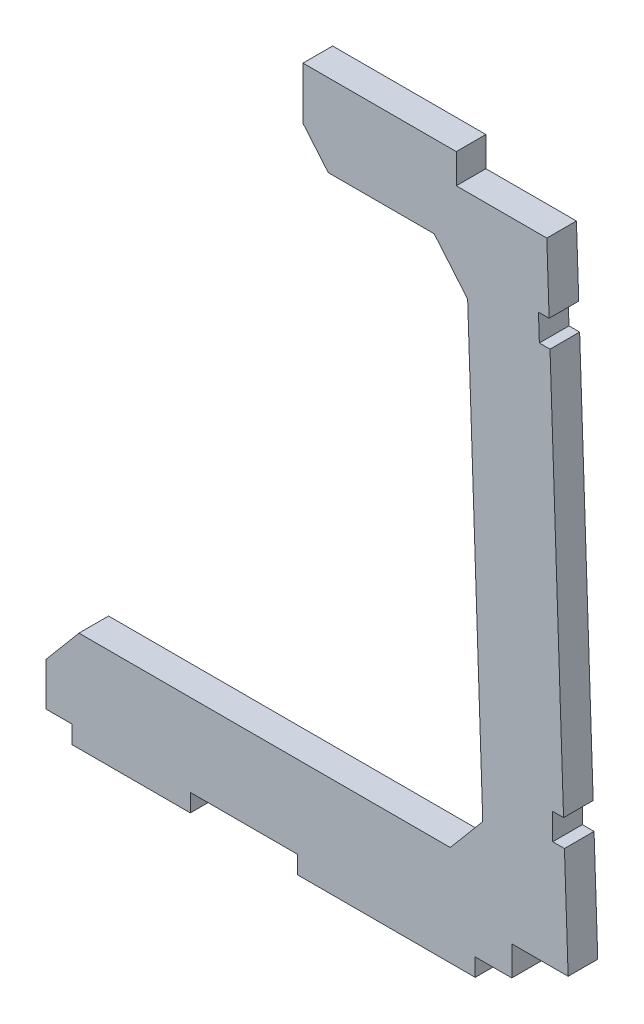
ISO-10303-21;
HEADER;
FILE_DESCRIPTION(('STEP AP214'),'2;1');
FILE_NAME('part.step','',(''),(''),'','','');
FILE_SCHEMA(('AUTOMOTIVE_DESIGN { 1 0 10303 214 1 1 1 1 }'));
ENDSEC;
DATA;
#1=APPLICATION_CONTEXT('core data for automotive mechanical design processes');
#2=APPLICATION_PROTOCOL_DEFINITION('international standard','automotive_design',2000,#1);
#3=PRODUCT_CONTEXT('',#1,'mechanical');
#4=PRODUCT('Part','Part','',(#3));
#5=PRODUCT_RELATED_PRODUCT_CATEGORY('part','',(#4));
#6=PRODUCT_DEFINITION_FORMATION('','',#4);
#7=PRODUCT_DEFINITION_CONTEXT('part definition',#1,'design');
#8=PRODUCT_DEFINITION('design','',#6,#7);
#9=PRODUCT_DEFINITION_SHAPE('','',#8);
#10=(LENGTH_UNIT() NAMED_UNIT(*) SI_UNIT(.MILLI.,.METRE.));
#11=(NAMED_UNIT(*) PLANE_ANGLE_UNIT() SI_UNIT($,.RADIAN.));
#12=(NAMED_UNIT(*) SI_UNIT($,.STERADIAN.) SOLID_ANGLE_UNIT());
#13=UNCERTAINTY_MEASURE_WITH_UNIT(LENGTH_MEASURE(1.E-05),#10,'distance_accuracy_value','');
#14=(GEOMETRIC_REPRESENTATION_CONTEXT(3) GLOBAL_UNCERTAINTY_ASSIGNED_CONTEXT((#13)) GLOBAL_UNIT_ASSIGNED_CONTEXT((#10,
#11,#12)) REPRESENTATION_CONTEXT('',''));
#15=CARTESIAN_POINT('',(0.,0.,0.));
#16=DIRECTION('',(0.,0.,1.));
#17=DIRECTION('',(1.,0.,0.));
#18=AXIS2_PLACEMENT_3D('',#15,#16,#17);
#19=CARTESIAN_POINT('',(0.,5.,5.));
#20=DIRECTION('',(0.,1.,0.));
#21=DIRECTION('',(0.,0.,1.));
#22=AXIS2_PLACEMENT_3D('',#19,#20,#21);
#23=PLANE('',#22);
#24=DIRECTION('',(1.,0.,0.));
#25=VECTOR('',#24,1.);
#26=CARTESIAN_POINT('',(0.,5.,0.));
#27=LINE('',#26,#25);
#28=CARTESIAN_POINT('',(97.6588701243486,5.,0.));
#29=VERTEX_POINT('',#28);
#30=CARTESIAN_POINT('',(107.170761617461,5.,0.));
#31=VERTEX_POINT('',#30);
#32=EDGE_CURVE('E279',#29,#31,#27,.T.);
#33=ORIENTED_EDGE('',*,*,#32,.T.);
#34=DIRECTION('',(0.,0.,-1.));
#35=VECTOR('',#34,1.);
#36=CARTESIAN_POINT('',(107.170761617461,5.,5.));
#37=LINE('',#36,#35);
#38=CARTESIAN_POINT('',(107.170761617461,5.,5.));
#39=VERTEX_POINT('',#38);
#40=EDGE_CURVE('E11',#39,#31,#37,.T.);
#41=ORIENTED_EDGE('',*,*,#40,.F.);
#42=DIRECTION('',(1.,0.,0.));
#43=VECTOR('',#42,1.);
#44=CARTESIAN_POINT('',(0.,5.,5.));
#45=LINE('',#44,#43);
#46=CARTESIAN_POINT('',(97.6588701243486,5.,5.));
#47=VERTEX_POINT('',#46);
#48=EDGE_CURVE('E358',#47,#39,#45,.T.);
#49=ORIENTED_EDGE('',*,*,#48,.F.);
#50=DIRECTION('',(0.,0.,-1.));
#51=VECTOR('',#50,1.);
#52=CARTESIAN_POINT('',(97.6588701243486,5.,5.));
#53=LINE('',#52,#51);
#54=EDGE_CURVE('E275',#47,#29,#53,.T.);
#55=ORIENTED_EDGE('',*,*,#54,.T.);
#56=EDGE_LOOP('',(#33,#41,#49,#55));
#57=FACE_BOUND('',#56,.T.);
#58=ADVANCED_FACE('F39',(#57),#23,.F.);
#59=CARTESIAN_POINT('',(107.216949366486,3.63924995126501,5.));
#60=DIRECTION('',(-0.999424438400247,-0.0339233242526677,0.));
#61=DIRECTION('',(0.0339233242526677,-0.999424438400247,0.));
#62=AXIS2_PLACEMENT_3D('',#59,#60,#61);
#63=PLANE('',#62);
#64=DIRECTION('',(-0.0339233242526677,0.999424438400247,0.));
#65=VECTOR('',#64,1.);
#66=CARTESIAN_POINT('',(107.216949366486,3.63924995126501,0.));
#67=LINE('',#66,#65);
#68=CARTESIAN_POINT('',(106.54703003609,23.3759286319028,0.));
#69=VERTEX_POINT('',#68);
#70=EDGE_CURVE('E282',#31,#69,#67,.T.);
#71=ORIENTED_EDGE('',*,*,#70,.T.);
#72=DIRECTION('',(0.,0.,-1.));
#73=VECTOR('',#72,1.);
#74=CARTESIAN_POINT('',(106.54703003609,23.3759286319028,5.));
#75=LINE('',#74,#73);
#76=CARTESIAN_POINT('',(106.54703003609,23.3759286319028,5.));
#77=VERTEX_POINT('',#76);
#78=EDGE_CURVE('E47',#77,#69,#75,.T.);
#79=ORIENTED_EDGE('',*,*,#78,.F.);
#80=DIRECTION('',(-0.0339233242526677,0.999424438400247,0.));
#81=VECTOR('',#80,1.);
#82=CARTESIAN_POINT('',(107.216949366486,3.63924995126501,5.));
#83=LINE('',#82,#81);
#84=EDGE_CURVE('E170',#39,#77,#83,.T.);
#85=ORIENTED_EDGE('',*,*,#84,.F.);
#86=ORIENTED_EDGE('',*,*,#40,.T.);
#87=EDGE_LOOP('',(#71,#79,#85,#86));
#88=FACE_BOUND('',#87,.T.);
#89=ADVANCED_FACE('F426',(#88),#63,.F.);
#90=CARTESIAN_POINT('',(0.,23.375928631903,5.));
#91=DIRECTION('',(0.,1.,0.));
#92=DIRECTION('',(-1.,0.,0.));
#93=AXIS2_PLACEMENT_3D('',#90,#91,#92);
#94=PLANE('',#93);
#95=DIRECTION('',(1.,0.,0.));
#96=VECTOR('',#95,1.);
#97=CARTESIAN_POINT('',(0.,23.375928631903,0.));
#98=LINE('',#97,#96);
#99=CARTESIAN_POINT('',(104.569940490293,23.3759286319028,0.));
#100=VERTEX_POINT('',#99);
#101=EDGE_CURVE('E285',#100,#69,#98,.T.);
#102=ORIENTED_EDGE('',*,*,#101,.F.);
#103=DIRECTION('',(0.,0.,-1.));
#104=VECTOR('',#103,1.);
#105=CARTESIAN_POINT('',(104.569940490293,23.3759286319028,5.));
#106=LINE('',#105,#104);
#107=CARTESIAN_POINT('',(104.569940490293,23.3759286319028,5.));
#108=VERTEX_POINT('',#107);
#109=EDGE_CURVE('E419',#108,#100,#106,.T.);
#110=ORIENTED_EDGE('',*,*,#109,.F.);
#111=DIRECTION('',(1.,0.,0.));
#112=VECTOR('',#111,1.);
#113=CARTESIAN_POINT('',(0.,23.375928631903,5.));
#114=LINE('',#113,#112);
#115=EDGE_CURVE('E425',#108,#77,#114,.T.);
#116=ORIENTED_EDGE('',*,*,#115,.T.);
#117=ORIENTED_EDGE('',*,*,#78,.T.);
#118=EDGE_LOOP('',(#102,#110,#116,#117));
#119=FACE_BOUND('',#118,.T.);
#120=ADVANCED_FACE('F423',(#119),#94,.T.);
#121=CARTESIAN_POINT('',(104.569940490293,0.,5.));
#122=DIRECTION('',(1.,0.,0.));
#123=DIRECTION('',(0.,0.,-1.));
#124=AXIS2_PLACEMENT_3D('',#121,#122,#123);
#125=PLANE('',#124);
#126=DIRECTION('',(0.,-1.,0.));
#127=VECTOR('',#126,1.);
#128=CARTESIAN_POINT('',(104.569940490293,0.,0.));
#129=LINE('',#128,#127);
#130=CARTESIAN_POINT('',(104.569940490293,27.8169237547511,0.));
#131=VERTEX_POINT('',#130);
#132=EDGE_CURVE('E290',#131,#100,#129,.T.);
#133=ORIENTED_EDGE('',*,*,#132,.F.);
#134=DIRECTION('',(0.,0.,-1.));
#135=VECTOR('',#134,1.);
#136=CARTESIAN_POINT('',(104.569940490293,27.8169237547511,5.));
#137=LINE('',#136,#135);
#138=CARTESIAN_POINT('',(104.569940490293,27.8169237547511,5.));
#139=VERTEX_POINT('',#138);
#140=EDGE_CURVE('E417',#139,#131,#137,.T.);
#141=ORIENTED_EDGE('',*,*,#140,.F.);
#142=DIRECTION('',(0.,-1.,0.));
#143=VECTOR('',#142,1.);
#144=CARTESIAN_POINT('',(104.569940490293,0.,5.));
#145=LINE('',#144,#143);
#146=EDGE_CURVE('E438',#139,#108,#145,.T.);
#147=ORIENTED_EDGE('',*,*,#146,.T.);
#148=ORIENTED_EDGE('',*,*,#109,.T.);
#149=EDGE_LOOP('',(#133,#141,#147,#148));
#150=FACE_BOUND('',#149,.T.);
#151=ADVANCED_FACE('F435',(#150),#125,.T.);
#152=CARTESIAN_POINT('',(0.,27.8169237547511,5.));
#153=DIRECTION('',(0.,-1.,0.));
#154=DIRECTION('',(0.,0.,-1.));
#155=AXIS2_PLACEMENT_3D('',#152,#153,#154);
#156=PLANE('',#155);
#157=DIRECTION('',(-1.,0.,0.));
#158=VECTOR('',#157,1.);
#159=CARTESIAN_POINT('',(0.,27.8169237547511,0.));
#160=LINE('',#159,#158);
#161=CARTESIAN_POINT('',(106.396289958333,27.8169237547511,0.));
#162=VERTEX_POINT('',#161);
#163=EDGE_CURVE('E293',#162,#131,#160,.T.);
#164=ORIENTED_EDGE('',*,*,#163,.F.);
#165=DIRECTION('',(0.,0.,-1.));
#166=VECTOR('',#165,1.);
#167=CARTESIAN_POINT('',(106.396289958333,27.8169237547511,5.));
#168=LINE('',#167,#166);
#169=CARTESIAN_POINT('',(106.396289958333,27.8169237547511,5.));
#170=VERTEX_POINT('',#169);
#171=EDGE_CURVE('E415',#170,#162,#168,.T.);
#172=ORIENTED_EDGE('',*,*,#171,.F.);
#173=DIRECTION('',(-1.,0.,0.));
#174=VECTOR('',#173,1.);
#175=CARTESIAN_POINT('',(0.,27.8169237547511,5.));
#176=LINE('',#175,#174);
#177=EDGE_CURVE('E442',#170,#139,#176,.T.);
#178=ORIENTED_EDGE('',*,*,#177,.T.);
#179=ORIENTED_EDGE('',*,*,#140,.T.);
#180=EDGE_LOOP('',(#164,#172,#178,#179));
#181=FACE_BOUND('',#180,.T.);
#182=ADVANCED_FACE('F538',(#181),#156,.T.);
#183=CARTESIAN_POINT('',(104.110516803685,95.1587188683433,0.));
#184=VERTEX_POINT('',#183);
#185=EDGE_CURVE('E287',#162,#184,#67,.T.);
#186=ORIENTED_EDGE('',*,*,#185,.T.);
#187=DIRECTION('',(0.,0.,-1.));
#188=VECTOR('',#187,1.);
#189=CARTESIAN_POINT('',(104.110516803685,95.1587188683433,5.));
#190=LINE('',#189,#188);
#191=CARTESIAN_POINT('',(104.110516803685,95.1587188683433,5.));
#192=VERTEX_POINT('',#191);
#193=EDGE_CURVE('E413',#192,#184,#190,.T.);
#194=ORIENTED_EDGE('',*,*,#193,.F.);
#195=EDGE_CURVE('E446',#170,#192,#83,.T.);
#196=ORIENTED_EDGE('',*,*,#195,.F.);
#197=ORIENTED_EDGE('',*,*,#171,.T.);
#198=EDGE_LOOP('',(#186,#194,#196,#197));
#199=FACE_BOUND('',#198,.T.);
#200=ADVANCED_FACE('F529',(#199),#63,.F.);
#201=CARTESIAN_POINT('',(0.,95.1587188683433,5.));
#202=DIRECTION('',(0.,1.,0.));
#203=DIRECTION('',(0.,0.,1.));
#204=AXIS2_PLACEMENT_3D('',#201,#202,#203);
#205=PLANE('',#204);
#206=DIRECTION('',(1.,0.,0.));
#207=VECTOR('',#206,1.);
#208=CARTESIAN_POINT('',(0.,95.1587188683433,0.));
#209=LINE('',#208,#207);
#210=CARTESIAN_POINT('',(102.311123928865,95.1587188683433,0.));
#211=VERTEX_POINT('',#210);
#212=EDGE_CURVE('E296',#211,#184,#209,.T.);
#213=ORIENTED_EDGE('',*,*,#212,.F.);
#214=DIRECTION('',(0.,0.,-1.));
#215=VECTOR('',#214,1.);
#216=CARTESIAN_POINT('',(102.311123928865,95.1587188683433,5.));
#217=LINE('',#216,#215);
#218=CARTESIAN_POINT('',(102.311123928865,95.1587188683433,5.));
#219=VERTEX_POINT('',#218);
#220=EDGE_CURVE('E411',#219,#211,#217,.T.);
#221=ORIENTED_EDGE('',*,*,#220,.F.);
#222=DIRECTION('',(1.,0.,0.));
#223=VECTOR('',#222,1.);
#224=CARTESIAN_POINT('',(0.,95.1587188683433,5.));
#225=LINE('',#224,#223);
#226=EDGE_CURVE('E450',#219,#192,#225,.T.);
#227=ORIENTED_EDGE('',*,*,#226,.T.);
#228=ORIENTED_EDGE('',*,*,#193,.T.);
#229=EDGE_LOOP('',(#213,#221,#227,#228));
#230=FACE_BOUND('',#229,.T.);
#231=ADVANCED_FACE('F537',(#230),#205,.T.);
#232=CARTESIAN_POINT('',(105.419627218463,3.57824369639347,5.));
#233=DIRECTION('',(0.999424438400247,0.0339233242526676,0.));
#234=DIRECTION('',(-0.0339233242526676,0.999424438400247,0.));
#235=AXIS2_PLACEMENT_3D('',#232,#233,#234);
#236=PLANE('',#235);
#237=DIRECTION('',(0.0339233242526676,-0.999424438400247,0.));
#238=VECTOR('',#237,1.);
#239=CARTESIAN_POINT('',(105.419627218463,3.57824369639347,0.));
#240=LINE('',#239,#238);
#241=CARTESIAN_POINT('',(102.160383851108,99.5997139911916,0.));
#242=VERTEX_POINT('',#241);
#243=EDGE_CURVE('E299',#242,#211,#240,.T.);
#244=ORIENTED_EDGE('',*,*,#243,.F.);
#245=DIRECTION('',(0.,0.,-1.));
#246=VECTOR('',#245,1.);
#247=CARTESIAN_POINT('',(102.160383851108,99.5997139911916,5.));
#248=LINE('',#247,#246);
#249=CARTESIAN_POINT('',(102.160383851108,99.5997139911916,5.));
#250=VERTEX_POINT('',#249);
#251=EDGE_CURVE('E409',#250,#242,#248,.T.);
#252=ORIENTED_EDGE('',*,*,#251,.F.);
#253=DIRECTION('',(0.0339233242526676,-0.999424438400247,0.));
#254=VECTOR('',#253,1.);
#255=CARTESIAN_POINT('',(105.419627218463,3.57824369639347,5.));
#256=LINE('',#255,#254);
#257=EDGE_CURVE('E453',#250,#219,#256,.T.);
#258=ORIENTED_EDGE('',*,*,#257,.T.);
#259=ORIENTED_EDGE('',*,*,#220,.T.);
#260=EDGE_LOOP('',(#244,#252,#258,#259));
#261=FACE_BOUND('',#260,.T.);
#262=ADVANCED_FACE('F550',(#261),#236,.T.);
#263=CARTESIAN_POINT('',(0.,99.5997139911916,5.));
#264=DIRECTION('',(0.,-1.,0.));
#265=DIRECTION('',(0.,0.,-1.));
#266=AXIS2_PLACEMENT_3D('',#263,#264,#265);
#267=PLANE('',#266);
#268=DIRECTION('',(-1.,0.,0.));
#269=VECTOR('',#268,1.);
#270=CARTESIAN_POINT('',(0.,99.5997139911916,0.));
#271=LINE('',#270,#269);
#272=CARTESIAN_POINT('',(103.959776725927,99.5997139911916,0.));
#273=VERTEX_POINT('',#272);
#274=EDGE_CURVE('E302',#273,#242,#271,.T.);
#275=ORIENTED_EDGE('',*,*,#274,.F.);
#276=DIRECTION('',(0.,0.,-1.));
#277=VECTOR('',#276,1.);
#278=CARTESIAN_POINT('',(103.959776725927,99.5997139911916,5.));
#279=LINE('',#278,#277);
#280=CARTESIAN_POINT('',(103.959776725927,99.5997139911916,5.));
#281=VERTEX_POINT('',#280);
#282=EDGE_CURVE('E407',#281,#273,#279,.T.);
#283=ORIENTED_EDGE('',*,*,#282,.F.);
#284=DIRECTION('',(-1.,0.,0.));
#285=VECTOR('',#284,1.);
#286=CARTESIAN_POINT('',(0.,99.5997139911916,5.));
#287=LINE('',#286,#285);
#288=EDGE_CURVE('E456',#281,#250,#287,.T.);
#289=ORIENTED_EDGE('',*,*,#288,.T.);
#290=ORIENTED_EDGE('',*,*,#251,.T.);
#291=EDGE_LOOP('',(#275,#283,#289,#290));
#292=FACE_BOUND('',#291,.T.);
#293=ADVANCED_FACE('F542',(#292),#267,.T.);
#294=CARTESIAN_POINT('',(103.5684461664,111.128811840558,0.));
#295=VERTEX_POINT('',#294);
#296=EDGE_CURVE('E286',#273,#295,#67,.T.);
#297=ORIENTED_EDGE('',*,*,#296,.T.);
#298=DIRECTION('',(0.,0.,-1.));
#299=VECTOR('',#298,1.);
#300=CARTESIAN_POINT('',(103.5684461664,111.128811840558,5.));
#301=LINE('',#300,#299);
#302=CARTESIAN_POINT('',(103.5684461664,111.128811840558,5.));
#303=VERTEX_POINT('',#302);
#304=EDGE_CURVE('E404',#303,#295,#301,.T.);
#305=ORIENTED_EDGE('',*,*,#304,.F.);
#306=EDGE_CURVE('E445',#281,#303,#83,.T.);
#307=ORIENTED_EDGE('',*,*,#306,.F.);
#308=ORIENTED_EDGE('',*,*,#282,.T.);
#309=EDGE_LOOP('',(#297,#305,#307,#308));
#310=FACE_BOUND('',#309,.T.);
#311=ADVANCED_FACE('F530',(#310),#63,.F.);
#312=CARTESIAN_POINT('',(0.,111.128811840558,5.));
#313=DIRECTION('',(0.,-1.,0.));
#314=DIRECTION('',(0.,0.,-1.));
#315=AXIS2_PLACEMENT_3D('',#312,#313,#314);
#316=PLANE('',#315);
#317=DIRECTION('',(-1.,0.,0.));
#318=VECTOR('',#317,1.);
#319=CARTESIAN_POINT('',(0.,111.128811840558,0.));
#320=LINE('',#319,#318);
#321=CARTESIAN_POINT('',(88.2854500094936,111.128811840558,0.));
#322=VERTEX_POINT('',#321);
#323=EDGE_CURVE('E305',#295,#322,#320,.T.);
#324=ORIENTED_EDGE('',*,*,#323,.T.);
#325=DIRECTION('',(0.,0.,-1.));
#326=VECTOR('',#325,1.);
#327=CARTESIAN_POINT('',(88.2854500094936,111.128811840558,5.));
#328=LINE('',#327,#326);
#329=CARTESIAN_POINT('',(88.2854500094936,111.128811840558,5.));
#330=VERTEX_POINT('',#329);
#331=EDGE_CURVE('E402',#330,#322,#328,.T.);
#332=ORIENTED_EDGE('',*,*,#331,.F.);
#333=DIRECTION('',(-1.,0.,0.));
#334=VECTOR('',#333,1.);
#335=CARTESIAN_POINT('',(0.,111.128811840558,5.));
#336=LINE('',#335,#334);
#337=EDGE_CURVE('E459',#303,#330,#336,.T.);
#338=ORIENTED_EDGE('',*,*,#337,.F.);
#339=ORIENTED_EDGE('',*,*,#304,.T.);
#340=EDGE_LOOP('',(#324,#332,#338,#339));
#341=FACE_BOUND('',#340,.T.);
#342=ADVANCED_FACE('F541',(#341),#316,.F.);
#343=CARTESIAN_POINT('',(88.2854500094933,-2.45041348349832E-13,5.));
#344=DIRECTION('',(1.,0.,0.));
#345=DIRECTION('',(0.,1.,0.));
#346=AXIS2_PLACEMENT_3D('',#343,#344,#345);
#347=PLANE('',#346);
#348=DIRECTION('',(0.,-1.,0.));
#349=VECTOR('',#348,1.);
#350=CARTESIAN_POINT('',(88.2854500094933,-2.45041348349832E-13,0.));
#351=LINE('',#350,#349);
#352=CARTESIAN_POINT('',(88.2854500094936,116.128811840558,0.));
#353=VERTEX_POINT('',#352);
#354=EDGE_CURVE('E308',#353,#322,#351,.T.);
#355=ORIENTED_EDGE('',*,*,#354,.F.);
#356=DIRECTION('',(0.,0.,-1.));
#357=VECTOR('',#356,1.);
#358=CARTESIAN_POINT('',(88.2854500094936,116.128811840558,5.));
#359=LINE('',#358,#357);
#360=CARTESIAN_POINT('',(88.2854500094936,116.128811840558,5.));
#361=VERTEX_POINT('',#360);
#362=EDGE_CURVE('E400',#361,#353,#359,.T.);
#363=ORIENTED_EDGE('',*,*,#362,.F.);
#364=DIRECTION('',(0.,-1.,0.));
#365=VECTOR('',#364,1.);
#366=CARTESIAN_POINT('',(88.2854500094933,-2.45041348349832E-13,5.));
#367=LINE('',#366,#365);
#368=EDGE_CURVE('E461',#361,#330,#367,.T.);
#369=ORIENTED_EDGE('',*,*,#368,.T.);
#370=ORIENTED_EDGE('',*,*,#331,.T.);
#371=EDGE_LOOP('',(#355,#363,#369,#370));
#372=FACE_BOUND('',#371,.T.);
#373=ADVANCED_FACE('F548',(#372),#347,.T.);
#374=CARTESIAN_POINT('',(0.,116.128811840558,5.));
#375=DIRECTION('',(0.,-1.,0.));
#376=DIRECTION('',(0.,0.,-1.));
#377=AXIS2_PLACEMENT_3D('',#374,#375,#376);
#378=PLANE('',#377);
#379=DIRECTION('',(-1.,0.,0.));
#380=VECTOR('',#379,1.);
#381=CARTESIAN_POINT('',(0.,116.128811840558,0.));
#382=LINE('',#381,#380);
#383=CARTESIAN_POINT('',(62.4139773491379,116.128811840558,0.));
#384=VERTEX_POINT('',#383);
#385=EDGE_CURVE('E311',#353,#384,#382,.T.);
#386=ORIENTED_EDGE('',*,*,#385,.T.);
#387=DIRECTION('',(0.,0.,-1.));
#388=VECTOR('',#387,1.);
#389=CARTESIAN_POINT('',(62.4139773491379,116.128811840558,5.));
#390=LINE('',#389,#388);
#391=CARTESIAN_POINT('',(62.4139773491379,116.128811840558,5.));
#392=VERTEX_POINT('',#391);
#393=EDGE_CURVE('E398',#392,#384,#390,.T.);
#394=ORIENTED_EDGE('',*,*,#393,.F.);
#395=DIRECTION('',(-1.,0.,0.));
#396=VECTOR('',#395,1.);
#397=CARTESIAN_POINT('',(0.,116.128811840558,5.));
#398=LINE('',#397,#396);
#399=EDGE_CURVE('E464',#361,#392,#398,.T.);
#400=ORIENTED_EDGE('',*,*,#399,.F.);
#401=ORIENTED_EDGE('',*,*,#362,.T.);
#402=EDGE_LOOP('',(#386,#394,#400,#401));
#403=FACE_BOUND('',#402,.T.);
#404=ADVANCED_FACE('F614',(#403),#378,.F.);
#405=CARTESIAN_POINT('',(62.4139773491379,0.,5.));
#406=DIRECTION('',(-1.,0.,0.));
#407=DIRECTION('',(0.,0.,1.));
#408=AXIS2_PLACEMENT_3D('',#405,#406,#407);
#409=PLANE('',#408);
#410=DIRECTION('',(0.,1.,0.));
#411=VECTOR('',#410,1.);
#412=CARTESIAN_POINT('',(62.4139773491379,0.,0.));
#413=LINE('',#412,#411);
#414=CARTESIAN_POINT('',(62.4139773491379,107.324012391048,0.));
#415=VERTEX_POINT('',#414);
#416=EDGE_CURVE('E314',#415,#384,#413,.T.);
#417=ORIENTED_EDGE('',*,*,#416,.F.);
#418=DIRECTION('',(0.,0.,-1.));
#419=VECTOR('',#418,1.);
#420=CARTESIAN_POINT('',(62.4139773491379,107.324012391048,5.));
#421=LINE('',#420,#419);
#422=CARTESIAN_POINT('',(62.4139773491379,107.324012391048,5.));
#423=VERTEX_POINT('',#422);
#424=EDGE_CURVE('E396',#423,#415,#421,.T.);
#425=ORIENTED_EDGE('',*,*,#424,.F.);
#426=DIRECTION('',(0.,1.,0.));
#427=VECTOR('',#426,1.);
#428=CARTESIAN_POINT('',(62.4139773491379,0.,5.));
#429=LINE('',#428,#427);
#430=EDGE_CURVE('E466',#423,#392,#429,.T.);
#431=ORIENTED_EDGE('',*,*,#430,.T.);
#432=ORIENTED_EDGE('',*,*,#393,.T.);
#433=EDGE_LOOP('',(#417,#425,#431,#432));
#434=FACE_BOUND('',#433,.T.);
#435=ADVANCED_FACE('F623',(#434),#409,.T.);
#436=CARTESIAN_POINT('',(89.4727851319211,75.0765810045999,5.));
#437=DIRECTION('',(0.766044443118974,0.642787609686544,0.));
#438=DIRECTION('',(-0.642787609686544,0.766044443118974,0.));
#439=AXIS2_PLACEMENT_3D('',#436,#437,#438);
#440=PLANE('',#439);
#441=DIRECTION('',(0.642787609686544,-0.766044443118974,0.));
#442=VECTOR('',#441,1.);
#443=CARTESIAN_POINT('',(89.4727851319211,75.0765810045999,0.));
#444=LINE('',#443,#442);
#445=CARTESIAN_POINT('',(66.6751813173171,102.245707253193,0.));
#446=VERTEX_POINT('',#445);
#447=EDGE_CURVE('E317',#415,#446,#444,.T.);
#448=ORIENTED_EDGE('',*,*,#447,.T.);
#449=DIRECTION('',(0.,0.,-1.));
#450=VECTOR('',#449,1.);
#451=CARTESIAN_POINT('',(66.6751813173171,102.245707253193,5.));
#452=LINE('',#451,#450);
#453=CARTESIAN_POINT('',(66.6751813173171,102.245707253193,5.));
#454=VERTEX_POINT('',#453);
#455=EDGE_CURVE('E394',#454,#446,#452,.T.);
#456=ORIENTED_EDGE('',*,*,#455,.F.);
#457=DIRECTION('',(0.642787609686544,-0.766044443118974,0.));
#458=VECTOR('',#457,1.);
#459=CARTESIAN_POINT('',(89.4727851319211,75.0765810045999,5.));
#460=LINE('',#459,#458);
#461=EDGE_CURVE('E469',#423,#454,#460,.T.);
#462=ORIENTED_EDGE('',*,*,#461,.F.);
#463=ORIENTED_EDGE('',*,*,#424,.T.);
#464=EDGE_LOOP('',(#448,#456,#462,#463));
#465=FACE_BOUND('',#464,.T.);
#466=ADVANCED_FACE('F633',(#465),#440,.F.);
#467=CARTESIAN_POINT('',(0.,102.245707253193,5.));
#468=DIRECTION('',(0.,-1.,0.));
#469=DIRECTION('',(0.,0.,-1.));
#470=AXIS2_PLACEMENT_3D('',#467,#468,#469);
#471=PLANE('',#470);
#472=DIRECTION('',(-1.,0.,0.));
#473=VECTOR('',#472,1.);
#474=CARTESIAN_POINT('',(0.,102.245707253193,0.));
#475=LINE('',#474,#473);
#476=CARTESIAN_POINT('',(84.5619268008205,102.245707253193,0.));
#477=VERTEX_POINT('',#476);
#478=EDGE_CURVE('E320',#477,#446,#475,.T.);
#479=ORIENTED_EDGE('',*,*,#478,.F.);
#480=DIRECTION('',(0.,0.,-1.));
#481=VECTOR('',#480,1.);
#482=CARTESIAN_POINT('',(84.5619268008205,102.245707253193,5.));
#483=LINE('',#482,#481);
#484=CARTESIAN_POINT('',(84.5619268008205,102.245707253193,5.));
#485=VERTEX_POINT('',#484);
#486=EDGE_CURVE('E392',#485,#477,#483,.T.);
#487=ORIENTED_EDGE('',*,*,#486,.F.);
#488=DIRECTION('',(-1.,0.,0.));
#489=VECTOR('',#488,1.);
#490=CARTESIAN_POINT('',(0.,102.245707253193,5.));
#491=LINE('',#490,#489);
#492=EDGE_CURVE('E471',#485,#454,#491,.T.);
#493=ORIENTED_EDGE('',*,*,#492,.T.);
#494=ORIENTED_EDGE('',*,*,#455,.T.);
#495=EDGE_LOOP('',(#479,#487,#493,#494));
#496=FACE_BOUND('',#495,.T.);
#497=ADVANCED_FACE('F643',(#496),#471,.T.);
#498=CARTESIAN_POINT('',(99.9691582524741,83.8840838187549,5.));
#499=DIRECTION('',(0.766044443118975,0.642787609686543,0.));
#500=DIRECTION('',(-0.642787609686543,0.766044443118975,0.));
#501=AXIS2_PLACEMENT_3D('',#498,#499,#500);
#502=PLANE('',#501);
#503=DIRECTION('',(0.642787609686543,-0.766044443118975,0.));
#504=VECTOR('',#503,1.);
#505=CARTESIAN_POINT('',(99.9691582524741,83.8840838187549,0.));
#506=LINE('',#505,#504);
#507=CARTESIAN_POINT('',(90.2072253138774,95.5179024689912,0.));
#508=VERTEX_POINT('',#507);
#509=EDGE_CURVE('E323',#477,#508,#506,.T.);
#510=ORIENTED_EDGE('',*,*,#509,.T.);
#511=DIRECTION('',(0.,0.,-1.));
#512=VECTOR('',#511,1.);
#513=CARTESIAN_POINT('',(90.2072253138774,95.5179024689912,5.));
#514=LINE('',#513,#512);
#515=CARTESIAN_POINT('',(90.2072253138774,95.5179024689912,5.));
#516=VERTEX_POINT('',#515);
#517=EDGE_CURVE('E390',#516,#508,#514,.T.);
#518=ORIENTED_EDGE('',*,*,#517,.F.);
#519=DIRECTION('',(0.642787609686543,-0.766044443118975,0.));
#520=VECTOR('',#519,1.);
#521=CARTESIAN_POINT('',(99.9691582524741,83.8840838187549,5.));
#522=LINE('',#521,#520);
#523=EDGE_CURVE('E474',#485,#516,#522,.T.);
#524=ORIENTED_EDGE('',*,*,#523,.F.);
#525=ORIENTED_EDGE('',*,*,#486,.T.);
#526=EDGE_LOOP('',(#510,#518,#524,#525));
#527=FACE_BOUND('',#526,.T.);
#528=ADVANCED_FACE('F653',(#527),#502,.F.);
#529=CARTESIAN_POINT('',(93.3418353610074,3.16828889271413,5.));
#530=DIRECTION('',(-0.999424438400247,-0.0339233242526675,0.));
#531=DIRECTION('',(0.0339233242526675,-0.999424438400247,0.));
#532=AXIS2_PLACEMENT_3D('',#529,#530,#531);
#533=PLANE('',#532);
#534=DIRECTION('',(-0.0339233242526675,0.999424438400247,0.));
#535=VECTOR('',#534,1.);
#536=CARTESIAN_POINT('',(93.3418353610074,3.16828889271413,0.));
#537=LINE('',#536,#535);
#538=CARTESIAN_POINT('',(92.756368756688,20.4168824522914,0.));
#539=VERTEX_POINT('',#538);
#540=EDGE_CURVE('E326',#539,#508,#537,.T.);
#541=ORIENTED_EDGE('',*,*,#540,.F.);
#542=DIRECTION('',(0.,0.,-1.));
#543=VECTOR('',#542,1.);
#544=CARTESIAN_POINT('',(92.756368756688,20.4168824522914,5.));
#545=LINE('',#544,#543);
#546=CARTESIAN_POINT('',(92.756368756688,20.4168824522914,5.));
#547=VERTEX_POINT('',#546);
#548=EDGE_CURVE('E388',#547,#539,#545,.T.);
#549=ORIENTED_EDGE('',*,*,#548,.F.);
#550=DIRECTION('',(-0.0339233242526675,0.999424438400247,0.));
#551=VECTOR('',#550,1.);
#552=CARTESIAN_POINT('',(93.3418353610074,3.16828889271413,5.));
#553=LINE('',#552,#551);
#554=EDGE_CURVE('E476',#547,#516,#553,.T.);
#555=ORIENTED_EDGE('',*,*,#554,.T.);
#556=ORIENTED_EDGE('',*,*,#517,.T.);
#557=EDGE_LOOP('',(#541,#549,#555,#556));
#558=FACE_BOUND('',#557,.T.);
#559=ADVANCED_FACE('F663',(#558),#533,.T.);
#560=CARTESIAN_POINT('',(44.3783195134669,-37.2378315360173,5.));
#561=DIRECTION('',(-0.76604444311898,0.642787609686537,0.));
#562=DIRECTION('',(-0.642787609686537,-0.76604444311898,0.));
#563=AXIS2_PLACEMENT_3D('',#560,#561,#562);
#564=PLANE('',#563);
#565=DIRECTION('',(0.642787609686537,0.76604444311898,0.));
#566=VECTOR('',#565,1.);
#567=CARTESIAN_POINT('',(44.3783195134669,-37.2378315360173,0.));
#568=LINE('',#567,#566);
#569=CARTESIAN_POINT('',(87.2738781600335,13.8831045873644,0.));
#570=VERTEX_POINT('',#569);
#571=EDGE_CURVE('E329',#570,#539,#568,.T.);
#572=ORIENTED_EDGE('',*,*,#571,.F.);
#573=DIRECTION('',(0.,0.,-1.));
#574=VECTOR('',#573,1.);
#575=CARTESIAN_POINT('',(87.2738781600335,13.8831045873644,5.));
#576=LINE('',#575,#574);
#577=CARTESIAN_POINT('',(87.2738781600335,13.8831045873644,5.));
#578=VERTEX_POINT('',#577);
#579=EDGE_CURVE('E386',#578,#570,#576,.T.);
#580=ORIENTED_EDGE('',*,*,#579,.F.);
#581=DIRECTION('',(0.642787609686537,0.76604444311898,0.));
#582=VECTOR('',#581,1.);
#583=CARTESIAN_POINT('',(44.3783195134669,-37.2378315360173,5.));
#584=LINE('',#583,#582);
#585=EDGE_CURVE('E479',#578,#547,#584,.T.);
#586=ORIENTED_EDGE('',*,*,#585,.T.);
#587=ORIENTED_EDGE('',*,*,#548,.T.);
#588=EDGE_LOOP('',(#572,#580,#586,#587));
#589=FACE_BOUND('',#588,.T.);
#590=ADVANCED_FACE('F673',(#589),#564,.T.);
#591=CARTESIAN_POINT('',(0.,13.8831045873644,5.));
#592=DIRECTION('',(0.,1.,0.));
#593=DIRECTION('',(0.,0.,1.));
#594=AXIS2_PLACEMENT_3D('',#591,#592,#593);
#595=PLANE('',#594);
#596=DIRECTION('',(1.,0.,0.));
#597=VECTOR('',#596,1.);
#598=CARTESIAN_POINT('',(0.,13.8831045873644,0.));
#599=LINE('',#598,#597);
#600=CARTESIAN_POINT('',(24.5888897837574,13.8831045873644,0.));
#601=VERTEX_POINT('',#600);
#602=EDGE_CURVE('E332',#601,#570,#599,.T.);
#603=ORIENTED_EDGE('',*,*,#602,.F.);
#604=DIRECTION('',(0.,0.,-1.));
#605=VECTOR('',#604,1.);
#606=CARTESIAN_POINT('',(24.5888897837574,13.8831045873644,5.));
#607=LINE('',#606,#605);
#608=CARTESIAN_POINT('',(24.5888897837574,13.8831045873644,5.));
#609=VERTEX_POINT('',#608);
#610=EDGE_CURVE('E384',#609,#601,#607,.T.);
#611=ORIENTED_EDGE('',*,*,#610,.F.);
#612=DIRECTION('',(1.,0.,0.));
#613=VECTOR('',#612,1.);
#614=CARTESIAN_POINT('',(0.,13.8831045873644,5.));
#615=LINE('',#614,#613);
#616=EDGE_CURVE('E482',#609,#578,#615,.T.);
#617=ORIENTED_EDGE('',*,*,#616,.T.);
#618=ORIENTED_EDGE('',*,*,#579,.T.);
#619=EDGE_LOOP('',(#603,#611,#617,#618));
#620=FACE_BOUND('',#619,.T.);
#621=ADVANCED_FACE('F683',(#620),#595,.T.);
#622=CARTESIAN_POINT('',(7.5932583260221,-6.37150026079891,5.));
#623=DIRECTION('',(-0.76604444311898,0.642787609686537,0.));
#624=DIRECTION('',(-0.642787609686537,-0.76604444311898,0.));
#625=AXIS2_PLACEMENT_3D('',#622,#623,#624);
#626=PLANE('',#625);
#627=DIRECTION('',(0.642787609686537,0.76604444311898,0.));
#628=VECTOR('',#627,1.);
#629=CARTESIAN_POINT('',(7.5932583260221,-6.37150026079891,0.));
#630=LINE('',#629,#628);
#631=CARTESIAN_POINT('',(19.0693522181391,7.30517586408008,0.));
#632=VERTEX_POINT('',#631);
#633=EDGE_CURVE('E335',#632,#601,#630,.T.);
#634=ORIENTED_EDGE('',*,*,#633,.F.);
#635=DIRECTION('',(0.,0.,-1.));
#636=VECTOR('',#635,1.);
#637=CARTESIAN_POINT('',(19.0693522181391,7.30517586408008,5.));
#638=LINE('',#637,#636);
#639=CARTESIAN_POINT('',(19.0693522181391,7.30517586408008,5.));
#640=VERTEX_POINT('',#639);
#641=EDGE_CURVE('E382',#640,#632,#638,.T.);
#642=ORIENTED_EDGE('',*,*,#641,.F.);
#643=DIRECTION('',(0.642787609686537,0.76604444311898,0.));
#644=VECTOR('',#643,1.);
#645=CARTESIAN_POINT('',(7.5932583260221,-6.37150026079891,5.));
#646=LINE('',#645,#644);
#647=EDGE_CURVE('E485',#640,#609,#646,.T.);
#648=ORIENTED_EDGE('',*,*,#647,.T.);
#649=ORIENTED_EDGE('',*,*,#610,.T.);
#650=EDGE_LOOP('',(#634,#642,#648,#649));
#651=FACE_BOUND('',#650,.T.);
#652=ADVANCED_FACE('F693',(#651),#626,.T.);
#653=CARTESIAN_POINT('',(19.0693522181391,0.,5.));
#654=DIRECTION('',(-1.,0.,0.));
#655=DIRECTION('',(0.,0.,1.));
#656=AXIS2_PLACEMENT_3D('',#653,#654,#655);
#657=PLANE('',#656);
#658=DIRECTION('',(0.,1.,0.));
#659=VECTOR('',#658,1.);
#660=CARTESIAN_POINT('',(19.0693522181391,0.,0.));
#661=LINE('',#660,#659);
#662=CARTESIAN_POINT('',(19.0693522181391,0.,0.));
#663=VERTEX_POINT('',#662);
#664=EDGE_CURVE('E338',#663,#632,#661,.T.);
#665=ORIENTED_EDGE('',*,*,#664,.F.);
#666=DIRECTION('',(0.,0.,-1.));
#667=VECTOR('',#666,1.);
#668=CARTESIAN_POINT('',(19.0693522181391,0.,5.));
#669=LINE('',#668,#667);
#670=CARTESIAN_POINT('',(19.0693522181391,0.,5.));
#671=VERTEX_POINT('',#670);
#672=EDGE_CURVE('E380',#671,#663,#669,.T.);
#673=ORIENTED_EDGE('',*,*,#672,.F.);
#674=DIRECTION('',(0.,1.,0.));
#675=VECTOR('',#674,1.);
#676=CARTESIAN_POINT('',(19.0693522181391,0.,5.));
#677=LINE('',#676,#675);
#678=EDGE_CURVE('E488',#671,#640,#677,.T.);
#679=ORIENTED_EDGE('',*,*,#678,.T.);
#680=ORIENTED_EDGE('',*,*,#641,.T.);
#681=EDGE_LOOP('',(#665,#673,#679,#680));
#682=FACE_BOUND('',#681,.T.);
#683=ADVANCED_FACE('F703',(#682),#657,.T.);
#684=CARTESIAN_POINT('',(0.,0.,5.));
#685=DIRECTION('',(0.,1.,0.));
#686=DIRECTION('',(0.,0.,1.));
#687=AXIS2_PLACEMENT_3D('',#684,#685,#686);
#688=PLANE('',#687);
#689=DIRECTION('',(1.,0.,0.));
#690=VECTOR('',#689,1.);
#691=CARTESIAN_POINT('',(0.,0.,0.));
#692=LINE('',#691,#690);
#693=CARTESIAN_POINT('',(23.3905099282776,0.,0.));
#694=VERTEX_POINT('',#693);
#695=EDGE_CURVE('E341',#663,#694,#692,.T.);
#696=ORIENTED_EDGE('',*,*,#695,.T.);
#697=DIRECTION('',(0.,0.,-1.));
#698=VECTOR('',#697,1.);
#699=CARTESIAN_POINT('',(23.3905099282776,0.,5.));
#700=LINE('',#699,#698);
#701=CARTESIAN_POINT('',(23.3905099282776,0.,5.));
#702=VERTEX_POINT('',#701);
#703=EDGE_CURVE('E377',#702,#694,#700,.T.);
#704=ORIENTED_EDGE('',*,*,#703,.F.);
#705=DIRECTION('',(1.,0.,0.));
#706=VECTOR('',#705,1.);
#707=CARTESIAN_POINT('',(0.,0.,5.));
#708=LINE('',#707,#706);
#709=EDGE_CURVE('E491',#671,#702,#708,.T.);
#710=ORIENTED_EDGE('',*,*,#709,.F.);
#711=ORIENTED_EDGE('',*,*,#672,.T.);
#712=EDGE_LOOP('',(#696,#704,#710,#711));
#713=FACE_BOUND('',#712,.T.);
#714=ADVANCED_FACE('F713',(#713),#688,.F.);
#715=CARTESIAN_POINT('',(23.3905099282776,0.,5.));
#716=DIRECTION('',(1.,0.,0.));
#717=DIRECTION('',(0.,1.,0.));
#718=AXIS2_PLACEMENT_3D('',#715,#716,#717);
#719=PLANE('',#718);
#720=DIRECTION('',(0.,-1.,0.));
#721=VECTOR('',#720,1.);
#722=CARTESIAN_POINT('',(23.3905099282776,0.,0.));
#723=LINE('',#722,#721);
#724=CARTESIAN_POINT('',(23.3905099282776,-3.,0.));
#725=VERTEX_POINT('',#724);
#726=EDGE_CURVE('E343',#694,#725,#723,.T.);
#727=ORIENTED_EDGE('',*,*,#726,.T.);
#728=DIRECTION('',(0.,0.,-1.));
#729=VECTOR('',#728,1.);
#730=CARTESIAN_POINT('',(23.3905099282776,-3.,5.));
#731=LINE('',#730,#729);
#732=CARTESIAN_POINT('',(23.3905099282776,-3.,5.));
#733=VERTEX_POINT('',#732);
#734=EDGE_CURVE('E374',#733,#725,#731,.T.);
#735=ORIENTED_EDGE('',*,*,#734,.F.);
#736=DIRECTION('',(0.,-1.,0.));
#737=VECTOR('',#736,1.);
#738=CARTESIAN_POINT('',(23.3905099282776,0.,5.));
#739=LINE('',#738,#737);
#740=EDGE_CURVE('E493',#702,#733,#739,.T.);
#741=ORIENTED_EDGE('',*,*,#740,.F.);
#742=ORIENTED_EDGE('',*,*,#703,.T.);
#743=EDGE_LOOP('',(#727,#735,#741,#742));
#744=FACE_BOUND('',#743,.T.);
#745=ADVANCED_FACE('F723',(#744),#719,.F.);
#746=CARTESIAN_POINT('',(0.,-3.,5.));
#747=DIRECTION('',(0.,1.,0.));
#748=DIRECTION('',(0.,0.,1.));
#749=AXIS2_PLACEMENT_3D('',#746,#747,#748);
#750=PLANE('',#749);
#751=DIRECTION('',(1.,0.,0.));
#752=VECTOR('',#751,1.);
#753=CARTESIAN_POINT('',(0.,-3.,0.));
#754=LINE('',#753,#752);
#755=CARTESIAN_POINT('',(43.3905099282776,-3.,0.));
#756=VERTEX_POINT('',#755);
#757=EDGE_CURVE('E345',#725,#756,#754,.T.);
#758=ORIENTED_EDGE('',*,*,#757,.T.);
#759=DIRECTION('',(0.,0.,-1.));
#760=VECTOR('',#759,1.);
#761=CARTESIAN_POINT('',(43.3905099282776,-3.,5.));
#762=LINE('',#761,#760);
#763=CARTESIAN_POINT('',(43.3905099282776,-3.,5.));
#764=VERTEX_POINT('',#763);
#765=EDGE_CURVE('E371',#764,#756,#762,.T.);
#766=ORIENTED_EDGE('',*,*,#765,.F.);
#767=DIRECTION('',(1.,0.,0.));
#768=VECTOR('',#767,1.);
#769=CARTESIAN_POINT('',(0.,-3.,5.));
#770=LINE('',#769,#768);
#771=EDGE_CURVE('E495',#733,#764,#770,.T.);
#772=ORIENTED_EDGE('',*,*,#771,.F.);
#773=ORIENTED_EDGE('',*,*,#734,.T.);
#774=EDGE_LOOP('',(#758,#766,#772,#773));
#775=FACE_BOUND('',#774,.T.);
#776=ADVANCED_FACE('F733',(#775),#750,.F.);
#777=CARTESIAN_POINT('',(43.3905099282776,0.,5.));
#778=DIRECTION('',(-1.,0.,0.));
#779=DIRECTION('',(0.,0.,1.));
#780=AXIS2_PLACEMENT_3D('',#777,#778,#779);
#781=PLANE('',#780);
#782=DIRECTION('',(0.,1.,0.));
#783=VECTOR('',#782,1.);
#784=CARTESIAN_POINT('',(43.3905099282776,0.,0.));
#785=LINE('',#784,#783);
#786=CARTESIAN_POINT('',(43.3905099282776,0.,0.));
#787=VERTEX_POINT('',#786);
#788=EDGE_CURVE('E347',#756,#787,#785,.T.);
#789=ORIENTED_EDGE('',*,*,#788,.T.);
#790=DIRECTION('',(0.,0.,-1.));
#791=VECTOR('',#790,1.);
#792=CARTESIAN_POINT('',(43.3905099282776,0.,5.));
#793=LINE('',#792,#791);
#794=CARTESIAN_POINT('',(43.3905099282776,0.,5.));
#795=VERTEX_POINT('',#794);
#796=EDGE_CURVE('E368',#795,#787,#793,.T.);
#797=ORIENTED_EDGE('',*,*,#796,.F.);
#798=DIRECTION('',(0.,1.,0.));
#799=VECTOR('',#798,1.);
#800=CARTESIAN_POINT('',(43.3905099282776,0.,5.));
#801=LINE('',#800,#799);
#802=EDGE_CURVE('E497',#764,#795,#801,.T.);
#803=ORIENTED_EDGE('',*,*,#802,.F.);
#804=ORIENTED_EDGE('',*,*,#765,.T.);
#805=EDGE_LOOP('',(#789,#797,#803,#804));
#806=FACE_BOUND('',#805,.T.);
#807=ADVANCED_FACE('F743',(#806),#781,.F.);
#808=CARTESIAN_POINT('',(0.,0.,5.));
#809=DIRECTION('',(0.,1.,0.));
#810=DIRECTION('',(0.,0.,1.));
#811=AXIS2_PLACEMENT_3D('',#808,#809,#810);
#812=PLANE('',#811);
#813=DIRECTION('',(1.,0.,0.));
#814=VECTOR('',#813,1.);
#815=CARTESIAN_POINT('',(0.,0.,0.));
#816=LINE('',#815,#814);
#817=CARTESIAN_POINT('',(61.4798596555911,0.,0.));
#818=VERTEX_POINT('',#817);
#819=EDGE_CURVE('E349',#787,#818,#816,.T.);
#820=ORIENTED_EDGE('',*,*,#819,.T.);
#821=DIRECTION('',(0.,0.,-1.));
#822=VECTOR('',#821,1.);
#823=CARTESIAN_POINT('',(61.4798596555911,0.,5.));
#824=LINE('',#823,#822);
#825=CARTESIAN_POINT('',(61.4798596555911,0.,5.));
#826=VERTEX_POINT('',#825);
#827=EDGE_CURVE('E365',#826,#818,#824,.T.);
#828=ORIENTED_EDGE('',*,*,#827,.F.);
#829=DIRECTION('',(1.,0.,0.));
#830=VECTOR('',#829,1.);
#831=CARTESIAN_POINT('',(0.,0.,5.));
#832=LINE('',#831,#830);
#833=EDGE_CURVE('E499',#795,#826,#832,.T.);
#834=ORIENTED_EDGE('',*,*,#833,.F.);
#835=ORIENTED_EDGE('',*,*,#796,.T.);
#836=EDGE_LOOP('',(#820,#828,#834,#835));
#837=FACE_BOUND('',#836,.T.);
#838=ADVANCED_FACE('F753',(#837),#812,.F.);
#839=CARTESIAN_POINT('',(61.4798596555911,0.,5.));
#840=DIRECTION('',(1.,0.,0.));
#841=DIRECTION('',(0.,0.,-1.));
#842=AXIS2_PLACEMENT_3D('',#839,#840,#841);
#843=PLANE('',#842);
#844=DIRECTION('',(0.,-1.,0.));
#845=VECTOR('',#844,1.);
#846=CARTESIAN_POINT('',(61.4798596555911,0.,0.));
#847=LINE('',#846,#845);
#848=CARTESIAN_POINT('',(61.4798596555911,-3.,0.));
#849=VERTEX_POINT('',#848);
#850=EDGE_CURVE('E351',#818,#849,#847,.T.);
#851=ORIENTED_EDGE('',*,*,#850,.T.);
#852=DIRECTION('',(0.,0.,-1.));
#853=VECTOR('',#852,1.);
#854=CARTESIAN_POINT('',(61.4798596555911,-3.,5.));
#855=LINE('',#854,#853);
#856=CARTESIAN_POINT('',(61.4798596555911,-3.,5.));
#857=VERTEX_POINT('',#856);
#858=EDGE_CURVE('E362',#857,#849,#855,.T.);
#859=ORIENTED_EDGE('',*,*,#858,.F.);
#860=DIRECTION('',(0.,-1.,0.));
#861=VECTOR('',#860,1.);
#862=CARTESIAN_POINT('',(61.4798596555911,0.,5.));
#863=LINE('',#862,#861);
#864=EDGE_CURVE('E501',#826,#857,#863,.T.);
#865=ORIENTED_EDGE('',*,*,#864,.F.);
#866=ORIENTED_EDGE('',*,*,#827,.T.);
#867=EDGE_LOOP('',(#851,#859,#865,#866));
#868=FACE_BOUND('',#867,.T.);
#869=ADVANCED_FACE('F507',(#868),#843,.F.);
#870=CARTESIAN_POINT('',(0.,-3.,5.));
#871=DIRECTION('',(0.,1.,0.));
#872=DIRECTION('',(0.,0.,1.));
#873=AXIS2_PLACEMENT_3D('',#870,#871,#872);
#874=PLANE('',#873);
#875=DIRECTION('',(1.,0.,0.));
#876=VECTOR('',#875,1.);
#877=CARTESIAN_POINT('',(0.,-3.,0.));
#878=LINE('',#877,#876);
#879=CARTESIAN_POINT('',(91.4798596555911,-3.,0.));
#880=VERTEX_POINT('',#879);
#881=EDGE_CURVE('E353',#849,#880,#878,.T.);
#882=ORIENTED_EDGE('',*,*,#881,.T.);
#883=DIRECTION('',(0.,0.,-1.));
#884=VECTOR('',#883,1.);
#885=CARTESIAN_POINT('',(91.4798596555911,-3.,5.));
#886=LINE('',#885,#884);
#887=CARTESIAN_POINT('',(91.4798596555911,-3.,5.));
#888=VERTEX_POINT('',#887);
#889=EDGE_CURVE('E270',#888,#880,#886,.T.);
#890=ORIENTED_EDGE('',*,*,#889,.F.);
#891=DIRECTION('',(1.,0.,0.));
#892=VECTOR('',#891,1.);
#893=CARTESIAN_POINT('',(0.,-3.,5.));
#894=LINE('',#893,#892);
#895=EDGE_CURVE('E261',#857,#888,#894,.T.);
#896=ORIENTED_EDGE('',*,*,#895,.F.);
#897=ORIENTED_EDGE('',*,*,#858,.T.);
#898=EDGE_LOOP('',(#882,#890,#896,#897));
#899=FACE_BOUND('',#898,.T.);
#900=ADVANCED_FACE('F511',(#899),#874,.F.);
#901=CARTESIAN_POINT('',(91.4798596555911,0.,5.));
#902=DIRECTION('',(-1.,0.,0.));
#903=DIRECTION('',(0.,0.,1.));
#904=AXIS2_PLACEMENT_3D('',#901,#902,#903);
#905=PLANE('',#904);
#906=DIRECTION('',(0.,1.,0.));
#907=VECTOR('',#906,1.);
#908=CARTESIAN_POINT('',(91.4798596555911,0.,0.));
#909=LINE('',#908,#907);
#910=CARTESIAN_POINT('',(91.4798596555911,0.,0.));
#911=VERTEX_POINT('',#910);
#912=EDGE_CURVE('E269',#880,#911,#909,.T.);
#913=ORIENTED_EDGE('',*,*,#912,.T.);
#914=DIRECTION('',(0.,0.,-1.));
#915=VECTOR('',#914,1.);
#916=CARTESIAN_POINT('',(91.4798596555911,0.,5.));
#917=LINE('',#916,#915);
#918=CARTESIAN_POINT('',(91.4798596555911,0.,5.));
#919=VERTEX_POINT('',#918);
#920=EDGE_CURVE('E266',#919,#911,#917,.T.);
#921=ORIENTED_EDGE('',*,*,#920,.F.);
#922=DIRECTION('',(0.,1.,0.));
#923=VECTOR('',#922,1.);
#924=CARTESIAN_POINT('',(91.4798596555911,0.,5.));
#925=LINE('',#924,#923);
#926=EDGE_CURVE('E255',#888,#919,#925,.T.);
#927=ORIENTED_EDGE('',*,*,#926,.F.);
#928=ORIENTED_EDGE('',*,*,#889,.T.);
#929=EDGE_LOOP('',(#913,#921,#927,#928));
#930=FACE_BOUND('',#929,.T.);
#931=ADVANCED_FACE('F267',(#930),#905,.F.);
#932=CARTESIAN_POINT('',(0.,0.,5.));
#933=DIRECTION('',(0.,1.,0.));
#934=DIRECTION('',(0.,0.,1.));
#935=AXIS2_PLACEMENT_3D('',#932,#933,#934);
#936=PLANE('',#935);
#937=DIRECTION('',(1.,0.,0.));
#938=VECTOR('',#937,1.);
#939=CARTESIAN_POINT('',(0.,0.,0.));
#940=LINE('',#939,#938);
#941=CARTESIAN_POINT('',(97.6588701243486,0.,0.));
#942=VERTEX_POINT('',#941);
#943=EDGE_CURVE('E156',#911,#942,#940,.T.);
#944=ORIENTED_EDGE('',*,*,#943,.T.);
#945=DIRECTION('',(0.,0.,-1.));
#946=VECTOR('',#945,1.);
#947=CARTESIAN_POINT('',(97.6588701243486,0.,5.));
#948=LINE('',#947,#946);
#949=CARTESIAN_POINT('',(97.6588701243486,0.,5.));
#950=VERTEX_POINT('',#949);
#951=EDGE_CURVE('E271',#950,#942,#948,.T.);
#952=ORIENTED_EDGE('',*,*,#951,.F.);
#953=DIRECTION('',(1.,0.,0.));
#954=VECTOR('',#953,1.);
#955=CARTESIAN_POINT('',(0.,0.,5.));
#956=LINE('',#955,#954);
#957=EDGE_CURVE('E259',#919,#950,#956,.T.);
#958=ORIENTED_EDGE('',*,*,#957,.F.);
#959=ORIENTED_EDGE('',*,*,#920,.T.);
#960=EDGE_LOOP('',(#944,#952,#958,#959));
#961=FACE_BOUND('',#960,.T.);
#962=ADVANCED_FACE('F273',(#961),#936,.F.);
#963=CARTESIAN_POINT('',(97.6588701243486,0.,5.));
#964=DIRECTION('',(-1.,0.,0.));
#965=DIRECTION('',(0.,0.,1.));
#966=AXIS2_PLACEMENT_3D('',#963,#964,#965);
#967=PLANE('',#966);
#968=DIRECTION('',(0.,1.,0.));
#969=VECTOR('',#968,1.);
#970=CARTESIAN_POINT('',(97.6588701243486,0.,0.));
#971=LINE('',#970,#969);
#972=EDGE_CURVE('E162',#942,#29,#971,.T.);
#973=ORIENTED_EDGE('',*,*,#972,.T.);
#974=ORIENTED_EDGE('',*,*,#54,.F.);
#975=DIRECTION('',(0.,1.,0.));
#976=VECTOR('',#975,1.);
#977=CARTESIAN_POINT('',(97.6588701243486,0.,5.));
#978=LINE('',#977,#976);
#979=EDGE_CURVE('E55',#950,#47,#978,.T.);
#980=ORIENTED_EDGE('',*,*,#979,.F.);
#981=ORIENTED_EDGE('',*,*,#951,.T.);
#982=EDGE_LOOP('',(#973,#974,#980,#981));
#983=FACE_BOUND('',#982,.T.);
#984=ADVANCED_FACE('F514',(#983),#967,.F.);
#985=CARTESIAN_POINT('',(0.,0.,5.));
#986=DIRECTION('',(0.,0.,1.));
#987=DIRECTION('',(1.,0.,0.));
#988=AXIS2_PLACEMENT_3D('',#985,#986,#987);
#989=PLANE('',#988);
#990=ORIENTED_EDGE('',*,*,#48,.T.);
#991=ORIENTED_EDGE('',*,*,#84,.T.);
#992=ORIENTED_EDGE('',*,*,#115,.F.);
#993=ORIENTED_EDGE('',*,*,#146,.F.);
#994=ORIENTED_EDGE('',*,*,#177,.F.);
#995=ORIENTED_EDGE('',*,*,#195,.T.);
#996=ORIENTED_EDGE('',*,*,#226,.F.);
#997=ORIENTED_EDGE('',*,*,#257,.F.);
#998=ORIENTED_EDGE('',*,*,#288,.F.);
#999=ORIENTED_EDGE('',*,*,#306,.T.);
#1000=ORIENTED_EDGE('',*,*,#337,.T.);
#1001=ORIENTED_EDGE('',*,*,#368,.F.);
#1002=ORIENTED_EDGE('',*,*,#399,.T.);
#1003=ORIENTED_EDGE('',*,*,#430,.F.);
#1004=ORIENTED_EDGE('',*,*,#461,.T.);
#1005=ORIENTED_EDGE('',*,*,#492,.F.);
#1006=ORIENTED_EDGE('',*,*,#523,.T.);
#1007=ORIENTED_EDGE('',*,*,#554,.F.);
#1008=ORIENTED_EDGE('',*,*,#585,.F.);
#1009=ORIENTED_EDGE('',*,*,#616,.F.);
#1010=ORIENTED_EDGE('',*,*,#647,.F.);
#1011=ORIENTED_EDGE('',*,*,#678,.F.);
#1012=ORIENTED_EDGE('',*,*,#709,.T.);
#1013=ORIENTED_EDGE('',*,*,#740,.T.);
#1014=ORIENTED_EDGE('',*,*,#771,.T.);
#1015=ORIENTED_EDGE('',*,*,#802,.T.);
#1016=ORIENTED_EDGE('',*,*,#833,.T.);
#1017=ORIENTED_EDGE('',*,*,#864,.T.);
#1018=ORIENTED_EDGE('',*,*,#895,.T.);
#1019=ORIENTED_EDGE('',*,*,#926,.T.);
#1020=ORIENTED_EDGE('',*,*,#957,.T.);
#1021=ORIENTED_EDGE('',*,*,#979,.T.);
#1022=EDGE_LOOP('',(#990,#991,#992,#993,#994,#995,#996,#997,#998,#999,#1000,#1001,#1002,#1003,
#1004,#1005,#1006,#1007,#1008,#1009,#1010,#1011,#1012,#1013,#1014,#1015,#1016,#1017,#1018,#1019,
#1020,#1021));
#1023=FACE_BOUND('',#1022,.T.);
#1024=ADVANCED_FACE('F257',(#1023),#989,.T.);
#1025=CARTESIAN_POINT('',(0.,0.,0.));
#1026=DIRECTION('',(0.,0.,1.));
#1027=DIRECTION('',(1.,0.,0.));
#1028=AXIS2_PLACEMENT_3D('',#1025,#1026,#1027);
#1029=PLANE('',#1028);
#1030=ORIENTED_EDGE('',*,*,#32,.F.);
#1031=ORIENTED_EDGE('',*,*,#972,.F.);
#1032=ORIENTED_EDGE('',*,*,#943,.F.);
#1033=ORIENTED_EDGE('',*,*,#912,.F.);
#1034=ORIENTED_EDGE('',*,*,#881,.F.);
#1035=ORIENTED_EDGE('',*,*,#850,.F.);
#1036=ORIENTED_EDGE('',*,*,#819,.F.);
#1037=ORIENTED_EDGE('',*,*,#788,.F.);
#1038=ORIENTED_EDGE('',*,*,#757,.F.);
#1039=ORIENTED_EDGE('',*,*,#726,.F.);
#1040=ORIENTED_EDGE('',*,*,#695,.F.);
#1041=ORIENTED_EDGE('',*,*,#664,.T.);
#1042=ORIENTED_EDGE('',*,*,#633,.T.);
#1043=ORIENTED_EDGE('',*,*,#602,.T.);
#1044=ORIENTED_EDGE('',*,*,#571,.T.);
#1045=ORIENTED_EDGE('',*,*,#540,.T.);
#1046=ORIENTED_EDGE('',*,*,#509,.F.);
#1047=ORIENTED_EDGE('',*,*,#478,.T.);
#1048=ORIENTED_EDGE('',*,*,#447,.F.);
#1049=ORIENTED_EDGE('',*,*,#416,.T.);
#1050=ORIENTED_EDGE('',*,*,#385,.F.);
#1051=ORIENTED_EDGE('',*,*,#354,.T.);
#1052=ORIENTED_EDGE('',*,*,#323,.F.);
#1053=ORIENTED_EDGE('',*,*,#296,.F.);
#1054=ORIENTED_EDGE('',*,*,#274,.T.);
#1055=ORIENTED_EDGE('',*,*,#243,.T.);
#1056=ORIENTED_EDGE('',*,*,#212,.T.);
#1057=ORIENTED_EDGE('',*,*,#185,.F.);
#1058=ORIENTED_EDGE('',*,*,#163,.T.);
#1059=ORIENTED_EDGE('',*,*,#132,.T.);
#1060=ORIENTED_EDGE('',*,*,#101,.T.);
#1061=ORIENTED_EDGE('',*,*,#70,.F.);
#1062=EDGE_LOOP('',(#1030,#1031,#1032,#1033,#1034,#1035,#1036,#1037,#1038,#1039,#1040,#1041,
#1042,#1043,#1044,#1045,#1046,#1047,#1048,#1049,#1050,#1051,#1052,#1053,#1054,#1055,#1056,#1057,
#1058,#1059,#1060,#1061));
#1063=FACE_BOUND('',#1062,.T.);
#1064=ADVANCED_FACE('F430',(#1063),#1029,.F.);
#1065=CLOSED_SHELL('',(#58,#89,#120,#151,#182,#200,#231,#262,#293,#311,#342,#373,#404,#435,#466,
#497,#528,#559,#590,#621,#652,#683,#714,#745,#776,#807,#838,#869,#900,#931,#962,#984,#1024,#1064));
#1066=MANIFOLD_SOLID_BREP('B2',#1065);
#1067=ADVANCED_BREP_SHAPE_REPRESENTATION('',(#18,#1066),#14);
#1068=SHAPE_DEFINITION_REPRESENTATION(#9,#1067);
ENDSEC;
END-ISO-10303-21;
